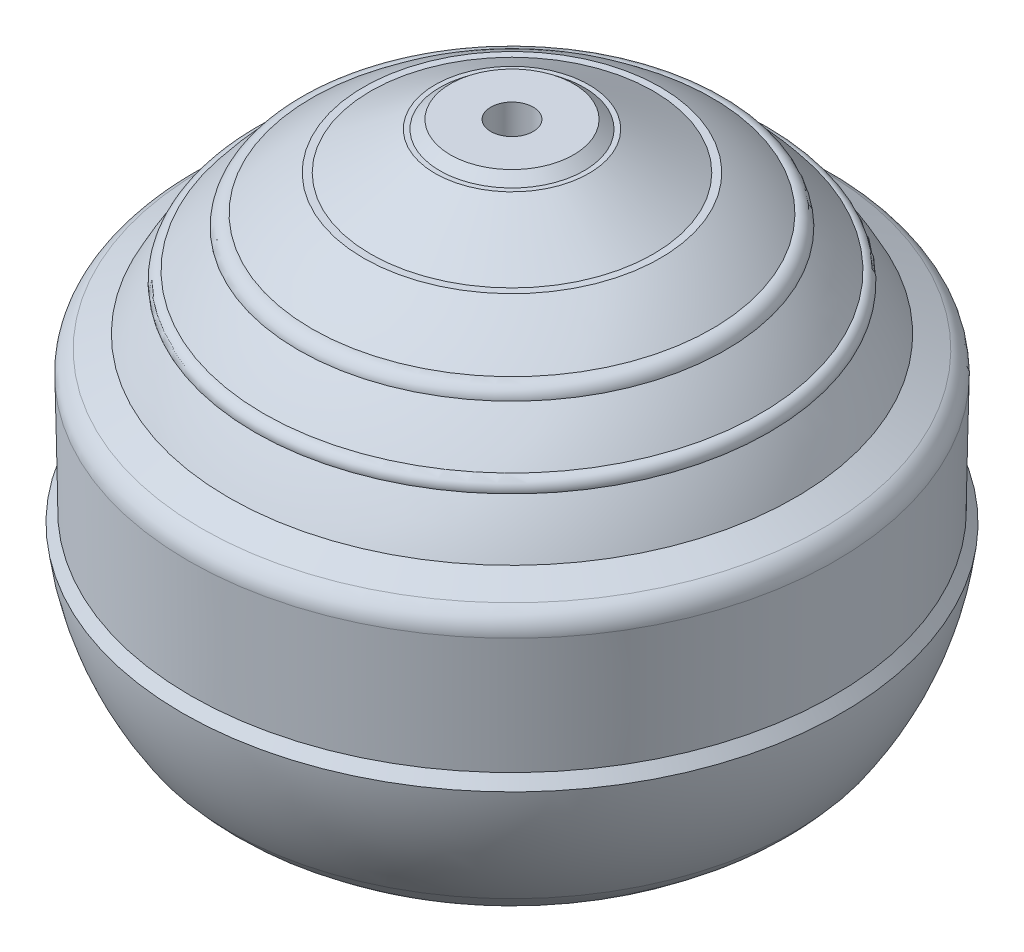
ISO-10303-21;
HEADER;
FILE_DESCRIPTION(('STEP AP214'),'2;1');
FILE_NAME('part.step','',(''),(''),'','','');
FILE_SCHEMA(('AUTOMOTIVE_DESIGN { 1 0 10303 214 1 1 1 1 }'));
ENDSEC;
DATA;
#1=APPLICATION_CONTEXT('core data for automotive mechanical design processes');
#2=APPLICATION_PROTOCOL_DEFINITION('international standard','automotive_design',2000,#1);
#3=PRODUCT_CONTEXT('',#1,'mechanical');
#4=PRODUCT('Part','Part','',(#3));
#5=PRODUCT_RELATED_PRODUCT_CATEGORY('part','',(#4));
#6=PRODUCT_DEFINITION_FORMATION('','',#4);
#7=PRODUCT_DEFINITION_CONTEXT('part definition',#1,'design');
#8=PRODUCT_DEFINITION('design','',#6,#7);
#9=PRODUCT_DEFINITION_SHAPE('','',#8);
#10=(LENGTH_UNIT() NAMED_UNIT(*) SI_UNIT(.MILLI.,.METRE.));
#11=(NAMED_UNIT(*) PLANE_ANGLE_UNIT() SI_UNIT($,.RADIAN.));
#12=(NAMED_UNIT(*) SI_UNIT($,.STERADIAN.) SOLID_ANGLE_UNIT());
#13=UNCERTAINTY_MEASURE_WITH_UNIT(LENGTH_MEASURE(1.E-05),#10,'distance_accuracy_value','');
#14=(GEOMETRIC_REPRESENTATION_CONTEXT(3) GLOBAL_UNCERTAINTY_ASSIGNED_CONTEXT((#13)) GLOBAL_UNIT_ASSIGNED_CONTEXT((#10,
#11,#12)) REPRESENTATION_CONTEXT('',''));
#15=CARTESIAN_POINT('',(0.,0.,0.));
#16=DIRECTION('',(0.,0.,1.));
#17=DIRECTION('',(1.,0.,0.));
#18=AXIS2_PLACEMENT_3D('',#15,#16,#17);
#19=CARTESIAN_POINT('',(0.,-14.,0.));
#20=DIRECTION('',(0.,1.,0.));
#21=DIRECTION('',(1.,0.,0.));
#22=AXIS2_PLACEMENT_3D('',#19,#20,#21);
#23=SPHERICAL_SURFACE('',#22,12.);
#24=CARTESIAN_POINT('',(0.,-21.637727134901,0.));
#25=DIRECTION('',(0.,1.,0.));
#26=DIRECTION('',(0.,0.,1.));
#27=AXIS2_PLACEMENT_3D('',#24,#25,#26);
#28=CIRCLE('',#27,9.25554559238932);
#29=CARTESIAN_POINT('',(0.,-21.637727134901,9.25554559238932));
#30=VERTEX_POINT('',#29);
#31=EDGE_CURVE('E10',#30,#30,#28,.T.);
#32=ORIENTED_EDGE('',*,*,#31,.F.);
#33=EDGE_LOOP('',(#32));
#34=FACE_BOUND('',#33,.T.);
#35=CARTESIAN_POINT('',(0.,-2.03379759489251,0.));
#36=DIRECTION('',(0.,-1.,0.));
#37=DIRECTION('',(0.,0.,-1.));
#38=AXIS2_PLACEMENT_3D('',#35,#36,#37);
#39=CIRCLE('',#38,0.9);
#40=CARTESIAN_POINT('',(0.,-2.03379759489251,-0.9));
#41=VERTEX_POINT('',#40);
#42=EDGE_CURVE('E88',#41,#41,#39,.F.);
#43=ORIENTED_EDGE('',*,*,#42,.T.);
#44=EDGE_LOOP('',(#43));
#45=FACE_BOUND('',#44,.T.);
#46=ADVANCED_FACE('F30',(#34,#45),#23,.F.);
#47=CARTESIAN_POINT('',(9.25554559238934,-21.637727134901,0.));
#48=DIRECTION('',(0.,1.,0.));
#49=DIRECTION('',(0.,0.,1.));
#50=AXIS2_PLACEMENT_3D('',#47,#48,#49);
#51=PLANE('',#50);
#52=CARTESIAN_POINT('',(0.,-21.637727134901,0.));
#53=DIRECTION('',(0.,1.,0.));
#54=DIRECTION('',(0.,0.,1.));
#55=AXIS2_PLACEMENT_3D('',#52,#53,#54);
#56=CIRCLE('',#55,10.2575018895566);
#57=CARTESIAN_POINT('',(0.,-21.637727134901,10.2575018895566));
#58=VERTEX_POINT('',#57);
#59=EDGE_CURVE('E36',#58,#58,#56,.T.);
#60=ORIENTED_EDGE('',*,*,#59,.F.);
#61=EDGE_LOOP('',(#60));
#62=FACE_BOUND('',#61,.T.);
#63=ORIENTED_EDGE('',*,*,#31,.T.);
#64=EDGE_LOOP('',(#63));
#65=FACE_BOUND('',#64,.T.);
#66=ADVANCED_FACE('F190',(#62,#65),#51,.F.);
#67=CARTESIAN_POINT('',(0.,-16.2688611046862,0.));
#68=DIRECTION('',(0.,1.,0.));
#69=DIRECTION('',(0.,0.,1.));
#70=AXIS2_PLACEMENT_3D('',#67,#68,#69);
#71=TOROIDAL_SURFACE('',#70,7.30537589321545,6.12697073182722);
#72=CARTESIAN_POINT('',(0.,-20.1628484349161,0.));
#73=DIRECTION('',(0.,1.,0.));
#74=DIRECTION('',(0.,0.,1.));
#75=AXIS2_PLACEMENT_3D('',#72,#73,#74);
#76=CIRCLE('',#75,12.0357704878213);
#77=CARTESIAN_POINT('',(0.,-20.1628484349161,12.0357704878213));
#78=VERTEX_POINT('',#77);
#79=EDGE_CURVE('E40',#78,#78,#76,.T.);
#80=ORIENTED_EDGE('',*,*,#79,.F.);
#81=EDGE_LOOP('',(#80));
#82=FACE_BOUND('',#81,.T.);
#83=ORIENTED_EDGE('',*,*,#59,.T.);
#84=EDGE_LOOP('',(#83));
#85=FACE_BOUND('',#84,.T.);
#86=ADVANCED_FACE('F185',(#82,#85),#71,.T.);
#87=CARTESIAN_POINT('',(0.,-13.4634424219215,0.));
#88=DIRECTION('',(0.,1.,0.));
#89=DIRECTION('',(0.,0.,1.));
#90=AXIS2_PLACEMENT_3D('',#87,#88,#89);
#91=DEGENERATE_TOROIDAL_SURFACE('',#90,2.07997021496259,12.,.T.);
#92=CARTESIAN_POINT('',(0.,-14.8465150605864,0.));
#93=DIRECTION('',(0.,1.,0.));
#94=DIRECTION('',(0.,0.,1.));
#95=AXIS2_PLACEMENT_3D('',#92,#93,#94);
#96=CIRCLE('',#95,14.);
#97=CARTESIAN_POINT('',(0.,-14.8465150605864,14.));
#98=VERTEX_POINT('',#97);
#99=EDGE_CURVE('E44',#98,#98,#96,.T.);
#100=ORIENTED_EDGE('',*,*,#99,.F.);
#101=EDGE_LOOP('',(#100));
#102=FACE_BOUND('',#101,.T.);
#103=ORIENTED_EDGE('',*,*,#79,.T.);
#104=EDGE_LOOP('',(#103));
#105=FACE_BOUND('',#104,.T.);
#106=ADVANCED_FACE('F179',(#102,#105),#91,.T.);
#107=CARTESIAN_POINT('',(0.,-14.8465150605864,0.));
#108=DIRECTION('',(0.,-1.,0.));
#109=DIRECTION('',(0.,0.,-1.));
#110=AXIS2_PLACEMENT_3D('',#107,#108,#109);
#111=CONICAL_SURFACE('',#110,14.,0.64538258116156);
#112=CARTESIAN_POINT('',(0.,-14.3816730279882,0.));
#113=DIRECTION('',(0.,1.,0.));
#114=DIRECTION('',(0.,0.,1.));
#115=AXIS2_PLACEMENT_3D('',#112,#113,#114);
#116=CIRCLE('',#115,13.6499999999999);
#117=CARTESIAN_POINT('',(0.,-14.3816730279882,13.6499999999999));
#118=VERTEX_POINT('',#117);
#119=EDGE_CURVE('E49',#118,#118,#116,.T.);
#120=ORIENTED_EDGE('',*,*,#119,.F.);
#121=EDGE_LOOP('',(#120));
#122=FACE_BOUND('',#121,.T.);
#123=ORIENTED_EDGE('',*,*,#99,.T.);
#124=EDGE_LOOP('',(#123));
#125=FACE_BOUND('',#124,.T.);
#126=ADVANCED_FACE('F173',(#122,#125),#111,.T.);
#127=CARTESIAN_POINT('',(0.,-14.3816730279882,0.));
#128=DIRECTION('',(0.,1.,0.));
#129=DIRECTION('',(0.,0.,1.));
#130=AXIS2_PLACEMENT_3D('',#127,#128,#129);
#131=CONICAL_SURFACE('',#130,13.6499999999999,0.0177438690323497);
#132=CARTESIAN_POINT('',(0.,-9.3800346648362,0.));
#133=DIRECTION('',(0.,1.,0.));
#134=DIRECTION('',(0.,0.,1.));
#135=AXIS2_PLACEMENT_3D('',#132,#133,#134);
#136=CIRCLE('',#135,13.7387577312311);
#137=CARTESIAN_POINT('',(0.,-9.3800346648362,13.7387577312311));
#138=VERTEX_POINT('',#137);
#139=EDGE_CURVE('E52',#138,#138,#136,.T.);
#140=ORIENTED_EDGE('',*,*,#139,.F.);
#141=EDGE_LOOP('',(#140));
#142=FACE_BOUND('',#141,.T.);
#143=ORIENTED_EDGE('',*,*,#119,.T.);
#144=EDGE_LOOP('',(#143));
#145=FACE_BOUND('',#144,.T.);
#146=ADVANCED_FACE('F167',(#142,#145),#131,.T.);
#147=CARTESIAN_POINT('',(0.,-9.36229172688359,0.));
#148=DIRECTION('',(0.,1.,0.));
#149=DIRECTION('',(0.,0.,1.));
#150=AXIS2_PLACEMENT_3D('',#147,#148,#149);
#151=TOROIDAL_SURFACE('',#150,12.7389151495449,1.00000000000004);
#152=CARTESIAN_POINT('',(0.,-8.46579271377194,0.));
#153=DIRECTION('',(0.,1.,0.));
#154=DIRECTION('',(0.,0.,1.));
#155=AXIS2_PLACEMENT_3D('',#152,#153,#154);
#156=CIRCLE('',#155,13.1819608802431);
#157=CARTESIAN_POINT('',(0.,-8.46579271377194,13.1819608802431));
#158=VERTEX_POINT('',#157);
#159=EDGE_CURVE('E55',#158,#158,#156,.T.);
#160=ORIENTED_EDGE('',*,*,#159,.F.);
#161=EDGE_LOOP('',(#160));
#162=FACE_BOUND('',#161,.T.);
#163=ORIENTED_EDGE('',*,*,#139,.T.);
#164=EDGE_LOOP('',(#163));
#165=FACE_BOUND('',#164,.T.);
#166=ADVANCED_FACE('F161',(#162,#165),#151,.T.);
#167=CARTESIAN_POINT('',(0.,-8.46579271377194,0.));
#168=DIRECTION('',(0.,-1.,0.));
#169=DIRECTION('',(0.,0.,-1.));
#170=AXIS2_PLACEMENT_3D('',#167,#168,#169);
#171=CONICAL_SURFACE('',#170,13.1819608802431,1.11180313322225);
#172=CARTESIAN_POINT('',(0.,-7.89935064021385,0.));
#173=DIRECTION('',(0.,1.,0.));
#174=DIRECTION('',(0.,0.,1.));
#175=AXIS2_PLACEMENT_3D('',#172,#173,#174);
#176=CIRCLE('',#175,12.0357704878213);
#177=CARTESIAN_POINT('',(0.,-7.89935064021385,12.0357704878213));
#178=VERTEX_POINT('',#177);
#179=EDGE_CURVE('E58',#178,#178,#176,.T.);
#180=ORIENTED_EDGE('',*,*,#179,.F.);
#181=EDGE_LOOP('',(#180));
#182=FACE_BOUND('',#181,.T.);
#183=ORIENTED_EDGE('',*,*,#159,.T.);
#184=EDGE_LOOP('',(#183));
#185=FACE_BOUND('',#184,.T.);
#186=ADVANCED_FACE('F155',(#182,#185),#171,.T.);
#187=CARTESIAN_POINT('',(0.,-14.2208265635886,0.));
#188=DIRECTION('',(0.,1.,0.));
#189=DIRECTION('',(0.,0.,1.));
#190=AXIS2_PLACEMENT_3D('',#187,#188,#189);
#191=DEGENERATE_TOROIDAL_SURFACE('',#190,0.455784345352706,14.,.F.);
#192=CARTESIAN_POINT('',(0.,-6.05983622658932,0.));
#193=DIRECTION('',(0.,1.,0.));
#194=DIRECTION('',(0.,0.,1.));
#195=AXIS2_PLACEMENT_3D('',#192,#193,#194);
#196=CIRCLE('',#195,10.9195502307995);
#197=CARTESIAN_POINT('',(0.,-6.05983622658932,10.9195502307995));
#198=VERTEX_POINT('',#197);
#199=EDGE_CURVE('E61',#198,#198,#196,.T.);
#200=ORIENTED_EDGE('',*,*,#199,.F.);
#201=EDGE_LOOP('',(#200));
#202=FACE_BOUND('',#201,.T.);
#203=ORIENTED_EDGE('',*,*,#179,.T.);
#204=EDGE_LOOP('',(#203));
#205=FACE_BOUND('',#204,.T.);
#206=ADVANCED_FACE('F149',(#202,#205),#191,.F.);
#207=CARTESIAN_POINT('',(0.,-5.96377320523149,0.));
#208=DIRECTION('',(0.,1.,0.));
#209=DIRECTION('',(0.,0.,1.));
#210=AXIS2_PLACEMENT_3D('',#207,#208,#209);
#211=TOROIDAL_SURFACE('',#210,10.5268429840381,0.404285896033104);
#212=CARTESIAN_POINT('',(0.,-5.55983622658919,0.));
#213=DIRECTION('',(0.,1.,0.));
#214=DIRECTION('',(0.,0.,1.));
#215=AXIS2_PLACEMENT_3D('',#212,#213,#214);
#216=CIRCLE('',#215,10.5436359294801);
#217=CARTESIAN_POINT('',(0.,-5.55983622658919,10.5436359294801));
#218=VERTEX_POINT('',#217);
#219=EDGE_CURVE('E64',#218,#218,#216,.T.);
#220=ORIENTED_EDGE('',*,*,#219,.F.);
#221=EDGE_LOOP('',(#220));
#222=FACE_BOUND('',#221,.T.);
#223=ORIENTED_EDGE('',*,*,#199,.T.);
#224=EDGE_LOOP('',(#223));
#225=FACE_BOUND('',#224,.T.);
#226=ADVANCED_FACE('F143',(#222,#225),#211,.T.);
#227=CARTESIAN_POINT('',(0.,-14.2208265635886,0.));
#228=DIRECTION('',(0.,1.,0.));
#229=DIRECTION('',(0.,0.,1.));
#230=AXIS2_PLACEMENT_3D('',#227,#228,#229);
#231=DEGENERATE_TOROIDAL_SURFACE('',#230,0.455784345352706,14.,.F.);
#232=CARTESIAN_POINT('',(0.,-3.95983622658918,0.));
#233=DIRECTION('',(0.,1.,0.));
#234=DIRECTION('',(0.,0.,1.));
#235=AXIS2_PLACEMENT_3D('',#232,#233,#234);
#236=CIRCLE('',#235,9.06850446295232);
#237=CARTESIAN_POINT('',(0.,-3.95983622658918,9.06850446295232));
#238=VERTEX_POINT('',#237);
#239=EDGE_CURVE('E67',#238,#238,#236,.T.);
#240=ORIENTED_EDGE('',*,*,#239,.F.);
#241=EDGE_LOOP('',(#240));
#242=FACE_BOUND('',#241,.T.);
#243=ORIENTED_EDGE('',*,*,#219,.T.);
#244=EDGE_LOOP('',(#243));
#245=FACE_BOUND('',#244,.T.);
#246=ADVANCED_FACE('F137',(#242,#245),#231,.F.);
#247=CARTESIAN_POINT('',(0.,-3.99743622218507,0.));
#248=DIRECTION('',(0.,1.,0.));
#249=DIRECTION('',(0.,0.,1.));
#250=AXIS2_PLACEMENT_3D('',#247,#248,#249);
#251=TOROIDAL_SURFACE('',#250,8.53129247945289,0.53852620631146);
#252=CARTESIAN_POINT('',(0.,-3.45983622658914,0.));
#253=DIRECTION('',(0.,1.,0.));
#254=DIRECTION('',(0.,0.,1.));
#255=AXIS2_PLACEMENT_3D('',#252,#253,#254);
#256=CIRCLE('',#255,8.49972161282764);
#257=CARTESIAN_POINT('',(0.,-3.45983622658914,8.49972161282764));
#258=VERTEX_POINT('',#257);
#259=EDGE_CURVE('E70',#258,#258,#256,.T.);
#260=ORIENTED_EDGE('',*,*,#259,.F.);
#261=EDGE_LOOP('',(#260));
#262=FACE_BOUND('',#261,.T.);
#263=ORIENTED_EDGE('',*,*,#239,.T.);
#264=EDGE_LOOP('',(#263));
#265=FACE_BOUND('',#264,.T.);
#266=ADVANCED_FACE('F131',(#262,#265),#251,.T.);
#267=CARTESIAN_POINT('',(0.,-14.2208265635886,0.));
#268=DIRECTION('',(0.,1.,0.));
#269=DIRECTION('',(0.,0.,1.));
#270=AXIS2_PLACEMENT_3D('',#267,#268,#269);
#271=DEGENERATE_TOROIDAL_SURFACE('',#270,0.455784345352706,14.,.F.);
#272=CARTESIAN_POINT('',(0.,-1.95983622658918,0.));
#273=DIRECTION('',(0.,1.,0.));
#274=DIRECTION('',(0.,0.,1.));
#275=AXIS2_PLACEMENT_3D('',#272,#273,#274);
#276=CIRCLE('',#275,6.30203453029099);
#277=CARTESIAN_POINT('',(0.,-1.95983622658918,6.30203453029099));
#278=VERTEX_POINT('',#277);
#279=EDGE_CURVE('E73',#278,#278,#276,.T.);
#280=ORIENTED_EDGE('',*,*,#279,.F.);
#281=EDGE_LOOP('',(#280));
#282=FACE_BOUND('',#281,.T.);
#283=ORIENTED_EDGE('',*,*,#259,.T.);
#284=EDGE_LOOP('',(#283));
#285=FACE_BOUND('',#284,.T.);
#286=ADVANCED_FACE('F125',(#282,#285),#271,.F.);
#287=CARTESIAN_POINT('',(6.30203453029099,-1.95983622658918,0.));
#288=DIRECTION('',(0.,-1.,0.));
#289=DIRECTION('',(0.,0.,-1.));
#290=AXIS2_PLACEMENT_3D('',#287,#288,#289);
#291=PLANE('',#290);
#292=CARTESIAN_POINT('',(0.,-1.95983622658918,0.));
#293=DIRECTION('',(0.,1.,0.));
#294=DIRECTION('',(0.,0.,1.));
#295=AXIS2_PLACEMENT_3D('',#292,#293,#294);
#296=CIRCLE('',#295,6.00203453029102);
#297=CARTESIAN_POINT('',(0.,-1.95983622658918,6.00203453029102));
#298=VERTEX_POINT('',#297);
#299=EDGE_CURVE('E76',#298,#298,#296,.T.);
#300=ORIENTED_EDGE('',*,*,#299,.F.);
#301=EDGE_LOOP('',(#300));
#302=FACE_BOUND('',#301,.T.);
#303=ORIENTED_EDGE('',*,*,#279,.T.);
#304=EDGE_LOOP('',(#303));
#305=FACE_BOUND('',#304,.T.);
#306=ADVANCED_FACE('F119',(#302,#305),#291,.F.);
#307=CARTESIAN_POINT('',(0.,-1.95983622658918,0.));
#308=DIRECTION('',(0.,-1.,0.));
#309=DIRECTION('',(0.,0.,-1.));
#310=AXIS2_PLACEMENT_3D('',#307,#308,#309);
#311=CONICAL_SURFACE('',#310,6.00203453029102,1.04160599140731);
#312=CARTESIAN_POINT('',(0.,-0.359836226589194,0.));
#313=DIRECTION('',(0.,1.,0.));
#314=DIRECTION('',(0.,0.,1.));
#315=AXIS2_PLACEMENT_3D('',#312,#313,#314);
#316=CIRCLE('',#315,3.26619632864616);
#317=CARTESIAN_POINT('',(0.,-0.359836226589194,3.26619632864616));
#318=VERTEX_POINT('',#317);
#319=EDGE_CURVE('E79',#318,#318,#316,.T.);
#320=ORIENTED_EDGE('',*,*,#319,.F.);
#321=EDGE_LOOP('',(#320));
#322=FACE_BOUND('',#321,.T.);
#323=ORIENTED_EDGE('',*,*,#299,.T.);
#324=EDGE_LOOP('',(#323));
#325=FACE_BOUND('',#324,.T.);
#326=ADVANCED_FACE('F113',(#322,#325),#311,.T.);
#327=CARTESIAN_POINT('',(3.26619632864616,-0.35983622658918,0.));
#328=DIRECTION('',(0.,-1.,0.));
#329=DIRECTION('',(0.,0.,-1.));
#330=AXIS2_PLACEMENT_3D('',#327,#328,#329);
#331=PLANE('',#330);
#332=CARTESIAN_POINT('',(0.,-0.359836226589166,0.));
#333=DIRECTION('',(0.,1.,0.));
#334=DIRECTION('',(0.,0.,1.));
#335=AXIS2_PLACEMENT_3D('',#332,#333,#334);
#336=CIRCLE('',#335,3.06619632864613);
#337=CARTESIAN_POINT('',(0.,-0.359836226589166,3.06619632864613));
#338=VERTEX_POINT('',#337);
#339=EDGE_CURVE('E82',#338,#338,#336,.T.);
#340=ORIENTED_EDGE('',*,*,#339,.F.);
#341=EDGE_LOOP('',(#340));
#342=FACE_BOUND('',#341,.T.);
#343=ORIENTED_EDGE('',*,*,#319,.T.);
#344=EDGE_LOOP('',(#343));
#345=FACE_BOUND('',#344,.T.);
#346=ADVANCED_FACE('F107',(#342,#345),#331,.F.);
#347=CARTESIAN_POINT('',(0.,-0.359836226589166,0.));
#348=DIRECTION('',(0.,-1.,0.));
#349=DIRECTION('',(0.,0.,-1.));
#350=AXIS2_PLACEMENT_3D('',#347,#348,#349);
#351=CONICAL_SURFACE('',#350,3.06619632864613,0.896055384571351);
#352=CARTESIAN_POINT('',(0.,0.,0.));
#353=DIRECTION('',(0.,1.,0.));
#354=DIRECTION('',(0.,0.,1.));
#355=AXIS2_PLACEMENT_3D('',#352,#353,#354);
#356=CIRCLE('',#355,2.61640104540967);
#357=CARTESIAN_POINT('',(0.,0.,2.61640104540967));
#358=VERTEX_POINT('',#357);
#359=EDGE_CURVE('E85',#358,#358,#356,.T.);
#360=ORIENTED_EDGE('',*,*,#359,.F.);
#361=EDGE_LOOP('',(#360));
#362=FACE_BOUND('',#361,.T.);
#363=ORIENTED_EDGE('',*,*,#339,.T.);
#364=EDGE_LOOP('',(#363));
#365=FACE_BOUND('',#364,.T.);
#366=ADVANCED_FACE('F101',(#362,#365),#351,.T.);
#367=CARTESIAN_POINT('',(2.61640104540967,0.,0.));
#368=DIRECTION('',(0.,-1.,0.));
#369=DIRECTION('',(0.,0.,-1.));
#370=AXIS2_PLACEMENT_3D('',#367,#368,#369);
#371=PLANE('',#370);
#372=CARTESIAN_POINT('',(0.,0.,0.));
#373=DIRECTION('',(0.,1.,0.));
#374=DIRECTION('',(0.,0.,1.));
#375=AXIS2_PLACEMENT_3D('',#372,#373,#374);
#376=CIRCLE('',#375,0.9);
#377=CARTESIAN_POINT('',(0.,0.,0.9));
#378=VERTEX_POINT('',#377);
#379=EDGE_CURVE('E91',#378,#378,#376,.T.);
#380=ORIENTED_EDGE('',*,*,#379,.F.);
#381=EDGE_LOOP('',(#380));
#382=FACE_BOUND('',#381,.T.);
#383=ORIENTED_EDGE('',*,*,#359,.T.);
#384=EDGE_LOOP('',(#383));
#385=FACE_BOUND('',#384,.T.);
#386=ADVANCED_FACE('F98',(#382,#385),#371,.F.);
#387=CARTESIAN_POINT('',(0.,-10.,0.));
#388=DIRECTION('',(0.,1.,0.));
#389=DIRECTION('',(0.,0.,1.));
#390=AXIS2_PLACEMENT_3D('',#387,#388,#389);
#391=CYLINDRICAL_SURFACE('',#390,0.9);
#392=ORIENTED_EDGE('',*,*,#379,.T.);
#393=EDGE_LOOP('',(#392));
#394=FACE_BOUND('',#393,.T.);
#395=ORIENTED_EDGE('',*,*,#42,.F.);
#396=EDGE_LOOP('',(#395));
#397=FACE_BOUND('',#396,.T.);
#398=ADVANCED_FACE('F95',(#394,#397),#391,.F.);
#399=CLOSED_SHELL('',(#46,#66,#86,#106,#126,#146,#166,#186,#206,#226,#246,#266,#286,#306,#326,
#346,#366,#386,#398));
#400=MANIFOLD_SOLID_BREP('B2',#399);
#401=ADVANCED_BREP_SHAPE_REPRESENTATION('',(#18,#400),#14);
#402=SHAPE_DEFINITION_REPRESENTATION(#9,#401);
ENDSEC;
END-ISO-10303-21;
